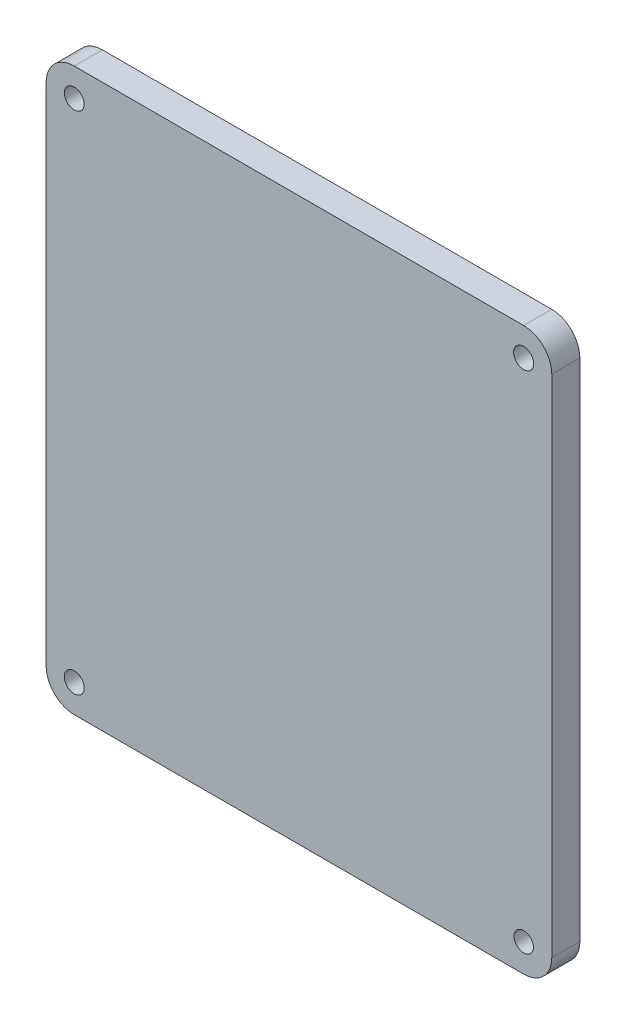
ISO-10303-21;
HEADER;
FILE_DESCRIPTION(('STEP AP214'),'2;1');
FILE_NAME('part.step','',(''),(''),'','','');
FILE_SCHEMA(('AUTOMOTIVE_DESIGN { 1 0 10303 214 1 1 1 1 }'));
ENDSEC;
DATA;
#1=APPLICATION_CONTEXT('core data for automotive mechanical design processes');
#2=APPLICATION_PROTOCOL_DEFINITION('international standard','automotive_design',2000,#1);
#3=PRODUCT_CONTEXT('',#1,'mechanical');
#4=PRODUCT('Part','Part','',(#3));
#5=PRODUCT_RELATED_PRODUCT_CATEGORY('part','',(#4));
#6=PRODUCT_DEFINITION_FORMATION('','',#4);
#7=PRODUCT_DEFINITION_CONTEXT('part definition',#1,'design');
#8=PRODUCT_DEFINITION('design','',#6,#7);
#9=PRODUCT_DEFINITION_SHAPE('','',#8);
#10=(LENGTH_UNIT() NAMED_UNIT(*) SI_UNIT(.MILLI.,.METRE.));
#11=(NAMED_UNIT(*) PLANE_ANGLE_UNIT() SI_UNIT($,.RADIAN.));
#12=(NAMED_UNIT(*) SI_UNIT($,.STERADIAN.) SOLID_ANGLE_UNIT());
#13=UNCERTAINTY_MEASURE_WITH_UNIT(LENGTH_MEASURE(1.E-05),#10,'distance_accuracy_value','');
#14=(GEOMETRIC_REPRESENTATION_CONTEXT(3) GLOBAL_UNCERTAINTY_ASSIGNED_CONTEXT((#13)) GLOBAL_UNIT_ASSIGNED_CONTEXT((#10,
#11,#12)) REPRESENTATION_CONTEXT('',''));
#15=CARTESIAN_POINT('',(0.,0.,0.));
#16=DIRECTION('',(0.,0.,1.));
#17=DIRECTION('',(1.,0.,0.));
#18=AXIS2_PLACEMENT_3D('',#15,#16,#17);
#19=CARTESIAN_POINT('',(93.2182324213359,-32.8306458602072,10.));
#20=DIRECTION('',(0.,0.,-1.));
#21=DIRECTION('',(-1.,0.,0.));
#22=AXIS2_PLACEMENT_3D('',#19,#20,#21);
#23=CYLINDRICAL_SURFACE('',#22,10.);
#24=CARTESIAN_POINT('',(93.2182324213359,-32.8306458602072,0.));
#25=DIRECTION('',(0.,0.,1.));
#26=DIRECTION('',(1.,0.,0.));
#27=AXIS2_PLACEMENT_3D('',#24,#25,#26);
#28=CIRCLE('',#27,10.);
#29=CARTESIAN_POINT('',(93.2182324213358,-42.8306458602072,0.));
#30=VERTEX_POINT('',#29);
#31=CARTESIAN_POINT('',(103.218232421336,-32.8306458602071,0.));
#32=VERTEX_POINT('',#31);
#33=EDGE_CURVE('E142',#30,#32,#28,.T.);
#34=ORIENTED_EDGE('',*,*,#33,.T.);
#35=DIRECTION('',(0.,0.,-1.));
#36=VECTOR('',#35,1.);
#37=CARTESIAN_POINT('',(103.218232421336,-32.8306458602071,10.));
#38=LINE('',#37,#36);
#39=CARTESIAN_POINT('',(103.218232421336,-32.8306458602071,10.));
#40=VERTEX_POINT('',#39);
#41=EDGE_CURVE('E11',#40,#32,#38,.T.);
#42=ORIENTED_EDGE('',*,*,#41,.F.);
#43=CARTESIAN_POINT('',(93.2182324213359,-32.8306458602072,10.));
#44=DIRECTION('',(0.,0.,1.));
#45=DIRECTION('',(1.,0.,0.));
#46=AXIS2_PLACEMENT_3D('',#43,#44,#45);
#47=CIRCLE('',#46,10.);
#48=CARTESIAN_POINT('',(93.2182324213358,-42.8306458602072,10.));
#49=VERTEX_POINT('',#48);
#50=EDGE_CURVE('E164',#49,#40,#47,.T.);
#51=ORIENTED_EDGE('',*,*,#50,.F.);
#52=DIRECTION('',(0.,0.,-1.));
#53=VECTOR('',#52,1.);
#54=CARTESIAN_POINT('',(93.2182324213358,-42.8306458602072,10.));
#55=LINE('',#54,#53);
#56=EDGE_CURVE('E138',#49,#30,#55,.T.);
#57=ORIENTED_EDGE('',*,*,#56,.T.);
#58=EDGE_LOOP('',(#34,#42,#51,#57));
#59=FACE_BOUND('',#58,.T.);
#60=ADVANCED_FACE('F39',(#59),#23,.T.);
#61=CARTESIAN_POINT('',(103.218232421336,-32.8306458602071,10.));
#62=DIRECTION('',(-1.,0.,0.));
#63=DIRECTION('',(0.,0.,1.));
#64=AXIS2_PLACEMENT_3D('',#61,#62,#63);
#65=PLANE('',#64);
#66=DIRECTION('',(0.,1.,0.));
#67=VECTOR('',#66,1.);
#68=CARTESIAN_POINT('',(103.218232421336,-32.8306458602071,0.));
#69=LINE('',#68,#67);
#70=CARTESIAN_POINT('',(103.218232421336,147.169354139793,0.));
#71=VERTEX_POINT('',#70);
#72=EDGE_CURVE('E146',#32,#71,#69,.T.);
#73=ORIENTED_EDGE('',*,*,#72,.T.);
#74=DIRECTION('',(0.,0.,-1.));
#75=VECTOR('',#74,1.);
#76=CARTESIAN_POINT('',(103.218232421336,147.169354139793,10.));
#77=LINE('',#76,#75);
#78=CARTESIAN_POINT('',(103.218232421336,147.169354139793,10.));
#79=VERTEX_POINT('',#78);
#80=EDGE_CURVE('E48',#79,#71,#77,.T.);
#81=ORIENTED_EDGE('',*,*,#80,.F.);
#82=DIRECTION('',(0.,1.,0.));
#83=VECTOR('',#82,1.);
#84=CARTESIAN_POINT('',(103.218232421336,-32.8306458602071,10.));
#85=LINE('',#84,#83);
#86=EDGE_CURVE('E99',#40,#79,#85,.T.);
#87=ORIENTED_EDGE('',*,*,#86,.F.);
#88=ORIENTED_EDGE('',*,*,#41,.T.);
#89=EDGE_LOOP('',(#73,#81,#87,#88));
#90=FACE_BOUND('',#89,.T.);
#91=ADVANCED_FACE('F272',(#90),#65,.F.);
#92=CARTESIAN_POINT('',(93.2182324213359,147.169354139793,10.));
#93=DIRECTION('',(0.,0.,-1.));
#94=DIRECTION('',(-1.,0.,0.));
#95=AXIS2_PLACEMENT_3D('',#92,#93,#94);
#96=CYLINDRICAL_SURFACE('',#95,10.);
#97=CARTESIAN_POINT('',(93.2182324213359,147.169354139793,0.));
#98=DIRECTION('',(0.,0.,1.));
#99=DIRECTION('',(1.,0.,0.));
#100=AXIS2_PLACEMENT_3D('',#97,#98,#99);
#101=CIRCLE('',#100,10.);
#102=CARTESIAN_POINT('',(93.2182324213358,157.169354139793,0.));
#103=VERTEX_POINT('',#102);
#104=EDGE_CURVE('E150',#71,#103,#101,.T.);
#105=ORIENTED_EDGE('',*,*,#104,.T.);
#106=DIRECTION('',(0.,0.,-1.));
#107=VECTOR('',#106,1.);
#108=CARTESIAN_POINT('',(93.2182324213358,157.169354139793,10.));
#109=LINE('',#108,#107);
#110=CARTESIAN_POINT('',(93.2182324213358,157.169354139793,10.));
#111=VERTEX_POINT('',#110);
#112=EDGE_CURVE('E175',#111,#103,#109,.T.);
#113=ORIENTED_EDGE('',*,*,#112,.F.);
#114=CARTESIAN_POINT('',(93.2182324213359,147.169354139793,10.));
#115=DIRECTION('',(0.,0.,1.));
#116=DIRECTION('',(1.,0.,0.));
#117=AXIS2_PLACEMENT_3D('',#114,#115,#116);
#118=CIRCLE('',#117,10.);
#119=EDGE_CURVE('E185',#79,#111,#118,.T.);
#120=ORIENTED_EDGE('',*,*,#119,.F.);
#121=ORIENTED_EDGE('',*,*,#80,.T.);
#122=EDGE_LOOP('',(#105,#113,#120,#121));
#123=FACE_BOUND('',#122,.T.);
#124=ADVANCED_FACE('F183',(#123),#96,.T.);
#125=CARTESIAN_POINT('',(93.2182324213358,157.169354139793,10.));
#126=DIRECTION('',(0.,-1.,0.));
#127=DIRECTION('',(1.,0.,0.));
#128=AXIS2_PLACEMENT_3D('',#125,#126,#127);
#129=PLANE('',#128);
#130=DIRECTION('',(-1.,0.,0.));
#131=VECTOR('',#130,1.);
#132=CARTESIAN_POINT('',(93.2182324213358,157.169354139793,0.));
#133=LINE('',#132,#131);
#134=CARTESIAN_POINT('',(-66.7817675786641,157.169354139793,0.));
#135=VERTEX_POINT('',#134);
#136=EDGE_CURVE('E153',#103,#135,#133,.T.);
#137=ORIENTED_EDGE('',*,*,#136,.T.);
#138=DIRECTION('',(0.,0.,-1.));
#139=VECTOR('',#138,1.);
#140=CARTESIAN_POINT('',(-66.7817675786641,157.169354139793,10.));
#141=LINE('',#140,#139);
#142=CARTESIAN_POINT('',(-66.7817675786641,157.169354139793,10.));
#143=VERTEX_POINT('',#142);
#144=EDGE_CURVE('E171',#143,#135,#141,.T.);
#145=ORIENTED_EDGE('',*,*,#144,.F.);
#146=DIRECTION('',(-1.,0.,0.));
#147=VECTOR('',#146,1.);
#148=CARTESIAN_POINT('',(93.2182324213358,157.169354139793,10.));
#149=LINE('',#148,#147);
#150=EDGE_CURVE('E198',#111,#143,#149,.T.);
#151=ORIENTED_EDGE('',*,*,#150,.F.);
#152=ORIENTED_EDGE('',*,*,#112,.T.);
#153=EDGE_LOOP('',(#137,#145,#151,#152));
#154=FACE_BOUND('',#153,.T.);
#155=ADVANCED_FACE('F193',(#154),#129,.F.);
#156=CARTESIAN_POINT('',(-66.7817675786641,147.169354139793,10.));
#157=DIRECTION('',(0.,0.,-1.));
#158=DIRECTION('',(-1.,0.,0.));
#159=AXIS2_PLACEMENT_3D('',#156,#157,#158);
#160=CYLINDRICAL_SURFACE('',#159,10.);
#161=CARTESIAN_POINT('',(-66.7817675786641,147.169354139793,0.));
#162=DIRECTION('',(0.,0.,1.));
#163=DIRECTION('',(1.,0.,0.));
#164=AXIS2_PLACEMENT_3D('',#161,#162,#163);
#165=CIRCLE('',#164,10.);
#166=CARTESIAN_POINT('',(-76.7817675786641,147.169354139793,0.));
#167=VERTEX_POINT('',#166);
#168=EDGE_CURVE('E156',#135,#167,#165,.T.);
#169=ORIENTED_EDGE('',*,*,#168,.T.);
#170=DIRECTION('',(0.,0.,-1.));
#171=VECTOR('',#170,1.);
#172=CARTESIAN_POINT('',(-76.7817675786641,147.169354139793,10.));
#173=LINE('',#172,#171);
#174=CARTESIAN_POINT('',(-76.7817675786641,147.169354139793,10.));
#175=VERTEX_POINT('',#174);
#176=EDGE_CURVE('E129',#175,#167,#173,.T.);
#177=ORIENTED_EDGE('',*,*,#176,.F.);
#178=CARTESIAN_POINT('',(-66.7817675786641,147.169354139793,10.));
#179=DIRECTION('',(0.,0.,1.));
#180=DIRECTION('',(1.,0.,0.));
#181=AXIS2_PLACEMENT_3D('',#178,#179,#180);
#182=CIRCLE('',#181,10.);
#183=EDGE_CURVE('E118',#143,#175,#182,.T.);
#184=ORIENTED_EDGE('',*,*,#183,.F.);
#185=ORIENTED_EDGE('',*,*,#144,.T.);
#186=EDGE_LOOP('',(#169,#177,#184,#185));
#187=FACE_BOUND('',#186,.T.);
#188=ADVANCED_FACE('F196',(#187),#160,.T.);
#189=CARTESIAN_POINT('',(-76.7817675786641,-32.8306458602072,10.));
#190=DIRECTION('',(1.,0.,0.));
#191=DIRECTION('',(0.,0.,-1.));
#192=AXIS2_PLACEMENT_3D('',#189,#190,#191);
#193=PLANE('',#192);
#194=DIRECTION('',(0.,-1.,0.));
#195=VECTOR('',#194,1.);
#196=CARTESIAN_POINT('',(-76.7817675786641,-32.8306458602072,0.));
#197=LINE('',#196,#195);
#198=CARTESIAN_POINT('',(-76.7817675786641,-32.8306458602072,0.));
#199=VERTEX_POINT('',#198);
#200=EDGE_CURVE('E127',#167,#199,#197,.T.);
#201=ORIENTED_EDGE('',*,*,#200,.T.);
#202=DIRECTION('',(0.,0.,-1.));
#203=VECTOR('',#202,1.);
#204=CARTESIAN_POINT('',(-76.7817675786641,-32.8306458602072,10.));
#205=LINE('',#204,#203);
#206=CARTESIAN_POINT('',(-76.7817675786641,-32.8306458602072,10.));
#207=VERTEX_POINT('',#206);
#208=EDGE_CURVE('E124',#207,#199,#205,.T.);
#209=ORIENTED_EDGE('',*,*,#208,.F.);
#210=DIRECTION('',(0.,-1.,0.));
#211=VECTOR('',#210,1.);
#212=CARTESIAN_POINT('',(-76.7817675786641,-32.8306458602072,10.));
#213=LINE('',#212,#211);
#214=EDGE_CURVE('E112',#175,#207,#213,.T.);
#215=ORIENTED_EDGE('',*,*,#214,.F.);
#216=ORIENTED_EDGE('',*,*,#176,.T.);
#217=EDGE_LOOP('',(#201,#209,#215,#216));
#218=FACE_BOUND('',#217,.T.);
#219=ADVANCED_FACE('F125',(#218),#193,.F.);
#220=CARTESIAN_POINT('',(-66.7817675786641,-32.8306458602072,10.));
#221=DIRECTION('',(0.,0.,-1.));
#222=DIRECTION('',(-1.,0.,0.));
#223=AXIS2_PLACEMENT_3D('',#220,#221,#222);
#224=CYLINDRICAL_SURFACE('',#223,10.);
#225=CARTESIAN_POINT('',(-66.7817675786641,-32.8306458602072,0.));
#226=DIRECTION('',(0.,0.,1.));
#227=DIRECTION('',(-1.,0.,0.));
#228=AXIS2_PLACEMENT_3D('',#225,#226,#227);
#229=CIRCLE('',#228,10.);
#230=CARTESIAN_POINT('',(-66.7817675786641,-42.8306458602072,0.));
#231=VERTEX_POINT('',#230);
#232=EDGE_CURVE('E85',#199,#231,#229,.T.);
#233=ORIENTED_EDGE('',*,*,#232,.T.);
#234=DIRECTION('',(0.,0.,-1.));
#235=VECTOR('',#234,1.);
#236=CARTESIAN_POINT('',(-66.7817675786641,-42.8306458602072,10.));
#237=LINE('',#236,#235);
#238=CARTESIAN_POINT('',(-66.7817675786641,-42.8306458602072,10.));
#239=VERTEX_POINT('',#238);
#240=EDGE_CURVE('E130',#239,#231,#237,.T.);
#241=ORIENTED_EDGE('',*,*,#240,.F.);
#242=CARTESIAN_POINT('',(-66.7817675786641,-32.8306458602072,10.));
#243=DIRECTION('',(0.,0.,1.));
#244=DIRECTION('',(-1.,0.,0.));
#245=AXIS2_PLACEMENT_3D('',#242,#243,#244);
#246=CIRCLE('',#245,10.);
#247=EDGE_CURVE('E116',#207,#239,#246,.T.);
#248=ORIENTED_EDGE('',*,*,#247,.F.);
#249=ORIENTED_EDGE('',*,*,#208,.T.);
#250=EDGE_LOOP('',(#233,#241,#248,#249));
#251=FACE_BOUND('',#250,.T.);
#252=ADVANCED_FACE('F132',(#251),#224,.T.);
#253=CARTESIAN_POINT('',(93.2182324213358,-42.8306458602072,10.));
#254=DIRECTION('',(0.,1.,0.));
#255=DIRECTION('',(-1.,0.,0.));
#256=AXIS2_PLACEMENT_3D('',#253,#254,#255);
#257=PLANE('',#256);
#258=DIRECTION('',(1.,0.,0.));
#259=VECTOR('',#258,1.);
#260=CARTESIAN_POINT('',(93.2182324213358,-42.8306458602072,0.));
#261=LINE('',#260,#259);
#262=EDGE_CURVE('E91',#231,#30,#261,.T.);
#263=ORIENTED_EDGE('',*,*,#262,.T.);
#264=ORIENTED_EDGE('',*,*,#56,.F.);
#265=DIRECTION('',(1.,0.,0.));
#266=VECTOR('',#265,1.);
#267=CARTESIAN_POINT('',(93.2182324213358,-42.8306458602072,10.));
#268=LINE('',#267,#266);
#269=EDGE_CURVE('E56',#239,#49,#268,.T.);
#270=ORIENTED_EDGE('',*,*,#269,.F.);
#271=ORIENTED_EDGE('',*,*,#240,.T.);
#272=EDGE_LOOP('',(#263,#264,#270,#271));
#273=FACE_BOUND('',#272,.T.);
#274=ADVANCED_FACE('F250',(#273),#257,.F.);
#275=CARTESIAN_POINT('',(93.2182324213359,-32.8306458602072,10.));
#276=DIRECTION('',(0.,0.,1.));
#277=DIRECTION('',(1.,0.,0.));
#278=AXIS2_PLACEMENT_3D('',#275,#276,#277);
#279=PLANE('',#278);
#280=CARTESIAN_POINT('',(-66.7817675786641,147.169354139793,10.));
#281=DIRECTION('',(0.,0.,1.));
#282=DIRECTION('',(1.,0.,0.));
#283=AXIS2_PLACEMENT_3D('',#280,#281,#282);
#284=CIRCLE('',#283,3.53179618900873);
#285=CARTESIAN_POINT('',(-63.2499713896554,147.169354139793,10.));
#286=VERTEX_POINT('',#285);
#287=EDGE_CURVE('E231',#286,#286,#284,.T.);
#288=ORIENTED_EDGE('',*,*,#287,.F.);
#289=EDGE_LOOP('',(#288));
#290=FACE_BOUND('',#289,.T.);
#291=CARTESIAN_POINT('',(93.2182324213359,147.169354139793,10.));
#292=DIRECTION('',(0.,0.,1.));
#293=DIRECTION('',(1.,0.,0.));
#294=AXIS2_PLACEMENT_3D('',#291,#292,#293);
#295=CIRCLE('',#294,3.57577798603825);
#296=CARTESIAN_POINT('',(96.7940104073741,147.169354139793,10.));
#297=VERTEX_POINT('',#296);
#298=EDGE_CURVE('E224',#297,#297,#295,.T.);
#299=ORIENTED_EDGE('',*,*,#298,.F.);
#300=EDGE_LOOP('',(#299));
#301=FACE_BOUND('',#300,.T.);
#302=CARTESIAN_POINT('',(93.2182324213359,-32.8306458602072,10.));
#303=DIRECTION('',(0.,0.,1.));
#304=DIRECTION('',(1.,0.,0.));
#305=AXIS2_PLACEMENT_3D('',#302,#303,#304);
#306=CIRCLE('',#305,3.45010174345161);
#307=CARTESIAN_POINT('',(96.6683341647875,-32.8306458602072,10.));
#308=VERTEX_POINT('',#307);
#309=EDGE_CURVE('E216',#308,#308,#306,.T.);
#310=ORIENTED_EDGE('',*,*,#309,.F.);
#311=EDGE_LOOP('',(#310));
#312=FACE_BOUND('',#311,.T.);
#313=CARTESIAN_POINT('',(-66.7817675786641,-32.8306458602072,10.));
#314=DIRECTION('',(0.,0.,1.));
#315=DIRECTION('',(1.,0.,0.));
#316=AXIS2_PLACEMENT_3D('',#313,#314,#315);
#317=CIRCLE('',#316,3.5575646024693);
#318=CARTESIAN_POINT('',(-63.2242029761949,-32.8306458602072,10.));
#319=VERTEX_POINT('',#318);
#320=EDGE_CURVE('E209',#319,#319,#317,.T.);
#321=ORIENTED_EDGE('',*,*,#320,.F.);
#322=EDGE_LOOP('',(#321));
#323=FACE_BOUND('',#322,.T.);
#324=ORIENTED_EDGE('',*,*,#50,.T.);
#325=ORIENTED_EDGE('',*,*,#86,.T.);
#326=ORIENTED_EDGE('',*,*,#119,.T.);
#327=ORIENTED_EDGE('',*,*,#150,.T.);
#328=ORIENTED_EDGE('',*,*,#183,.T.);
#329=ORIENTED_EDGE('',*,*,#214,.T.);
#330=ORIENTED_EDGE('',*,*,#247,.T.);
#331=ORIENTED_EDGE('',*,*,#269,.T.);
#332=EDGE_LOOP('',(#324,#325,#326,#327,#328,#329,#330,#331));
#333=FACE_BOUND('',#332,.T.);
#334=ADVANCED_FACE('F114',(#290,#301,#312,#323,#333),#279,.T.);
#335=CARTESIAN_POINT('',(93.2182324213359,-32.8306458602072,0.));
#336=DIRECTION('',(0.,0.,1.));
#337=DIRECTION('',(1.,0.,0.));
#338=AXIS2_PLACEMENT_3D('',#335,#336,#337);
#339=PLANE('',#338);
#340=CARTESIAN_POINT('',(-66.7817675786641,147.169354139793,0.));
#341=DIRECTION('',(0.,0.,1.));
#342=DIRECTION('',(1.,0.,0.));
#343=AXIS2_PLACEMENT_3D('',#340,#341,#342);
#344=CIRCLE('',#343,3.53179618900873);
#345=CARTESIAN_POINT('',(-63.2499713896554,147.169354139793,0.));
#346=VERTEX_POINT('',#345);
#347=EDGE_CURVE('E227',#346,#346,#344,.T.);
#348=ORIENTED_EDGE('',*,*,#347,.T.);
#349=EDGE_LOOP('',(#348));
#350=FACE_BOUND('',#349,.T.);
#351=CARTESIAN_POINT('',(93.2182324213359,147.169354139793,0.));
#352=DIRECTION('',(0.,0.,1.));
#353=DIRECTION('',(1.,0.,0.));
#354=AXIS2_PLACEMENT_3D('',#351,#352,#353);
#355=CIRCLE('',#354,3.57577798603825);
#356=CARTESIAN_POINT('',(96.7940104073741,147.169354139793,0.));
#357=VERTEX_POINT('',#356);
#358=EDGE_CURVE('E220',#357,#357,#355,.T.);
#359=ORIENTED_EDGE('',*,*,#358,.T.);
#360=EDGE_LOOP('',(#359));
#361=FACE_BOUND('',#360,.T.);
#362=CARTESIAN_POINT('',(93.2182324213359,-32.8306458602072,0.));
#363=DIRECTION('',(0.,0.,1.));
#364=DIRECTION('',(1.,0.,0.));
#365=AXIS2_PLACEMENT_3D('',#362,#363,#364);
#366=CIRCLE('',#365,3.45010174345161);
#367=CARTESIAN_POINT('',(96.6683341647875,-32.8306458602072,0.));
#368=VERTEX_POINT('',#367);
#369=EDGE_CURVE('E213',#368,#368,#366,.T.);
#370=ORIENTED_EDGE('',*,*,#369,.T.);
#371=EDGE_LOOP('',(#370));
#372=FACE_BOUND('',#371,.T.);
#373=CARTESIAN_POINT('',(-66.7817675786641,-32.8306458602072,0.));
#374=DIRECTION('',(0.,0.,1.));
#375=DIRECTION('',(1.,0.,0.));
#376=AXIS2_PLACEMENT_3D('',#373,#374,#375);
#377=CIRCLE('',#376,3.5575646024693);
#378=CARTESIAN_POINT('',(-63.2242029761949,-32.8306458602072,0.));
#379=VERTEX_POINT('',#378);
#380=EDGE_CURVE('E147',#379,#379,#377,.T.);
#381=ORIENTED_EDGE('',*,*,#380,.T.);
#382=EDGE_LOOP('',(#381));
#383=FACE_BOUND('',#382,.T.);
#384=ORIENTED_EDGE('',*,*,#33,.F.);
#385=ORIENTED_EDGE('',*,*,#262,.F.);
#386=ORIENTED_EDGE('',*,*,#232,.F.);
#387=ORIENTED_EDGE('',*,*,#200,.F.);
#388=ORIENTED_EDGE('',*,*,#168,.F.);
#389=ORIENTED_EDGE('',*,*,#136,.F.);
#390=ORIENTED_EDGE('',*,*,#104,.F.);
#391=ORIENTED_EDGE('',*,*,#72,.F.);
#392=EDGE_LOOP('',(#384,#385,#386,#387,#388,#389,#390,#391));
#393=FACE_BOUND('',#392,.T.);
#394=ADVANCED_FACE('F189',(#350,#361,#372,#383,#393),#339,.F.);
#395=CARTESIAN_POINT('',(-66.7817675786641,-32.8306458602072,0.));
#396=DIRECTION('',(0.,0.,1.));
#397=DIRECTION('',(1.,0.,0.));
#398=AXIS2_PLACEMENT_3D('',#395,#396,#397);
#399=CYLINDRICAL_SURFACE('',#398,3.5575646024693);
#400=ORIENTED_EDGE('',*,*,#380,.F.);
#401=EDGE_LOOP('',(#400));
#402=FACE_BOUND('',#401,.T.);
#403=ORIENTED_EDGE('',*,*,#320,.T.);
#404=EDGE_LOOP('',(#403));
#405=FACE_BOUND('',#404,.T.);
#406=ADVANCED_FACE('F258',(#402,#405),#399,.F.);
#407=CARTESIAN_POINT('',(93.2182324213359,-32.8306458602072,0.));
#408=DIRECTION('',(0.,0.,1.));
#409=DIRECTION('',(1.,0.,0.));
#410=AXIS2_PLACEMENT_3D('',#407,#408,#409);
#411=CYLINDRICAL_SURFACE('',#410,3.45010174345161);
#412=ORIENTED_EDGE('',*,*,#369,.F.);
#413=EDGE_LOOP('',(#412));
#414=FACE_BOUND('',#413,.T.);
#415=ORIENTED_EDGE('',*,*,#309,.T.);
#416=EDGE_LOOP('',(#415));
#417=FACE_BOUND('',#416,.T.);
#418=ADVANCED_FACE('F260',(#414,#417),#411,.F.);
#419=CARTESIAN_POINT('',(93.2182324213359,147.169354139793,0.));
#420=DIRECTION('',(0.,0.,1.));
#421=DIRECTION('',(1.,0.,0.));
#422=AXIS2_PLACEMENT_3D('',#419,#420,#421);
#423=CYLINDRICAL_SURFACE('',#422,3.57577798603825);
#424=ORIENTED_EDGE('',*,*,#358,.F.);
#425=EDGE_LOOP('',(#424));
#426=FACE_BOUND('',#425,.T.);
#427=ORIENTED_EDGE('',*,*,#298,.T.);
#428=EDGE_LOOP('',(#427));
#429=FACE_BOUND('',#428,.T.);
#430=ADVANCED_FACE('F244',(#426,#429),#423,.F.);
#431=CARTESIAN_POINT('',(-66.7817675786641,147.169354139793,0.));
#432=DIRECTION('',(0.,0.,1.));
#433=DIRECTION('',(1.,0.,0.));
#434=AXIS2_PLACEMENT_3D('',#431,#432,#433);
#435=CYLINDRICAL_SURFACE('',#434,3.53179618900873);
#436=ORIENTED_EDGE('',*,*,#347,.F.);
#437=EDGE_LOOP('',(#436));
#438=FACE_BOUND('',#437,.T.);
#439=ORIENTED_EDGE('',*,*,#287,.T.);
#440=EDGE_LOOP('',(#439));
#441=FACE_BOUND('',#440,.T.);
#442=ADVANCED_FACE('F241',(#438,#441),#435,.F.);
#443=CLOSED_SHELL('',(#60,#91,#124,#155,#188,#219,#252,#274,#334,#394,#406,#418,#430,#442));
#444=MANIFOLD_SOLID_BREP('B2',#443);
#445=ADVANCED_BREP_SHAPE_REPRESENTATION('',(#18,#444),#14);
#446=SHAPE_DEFINITION_REPRESENTATION(#9,#445);
ENDSEC;
END-ISO-10303-21;
